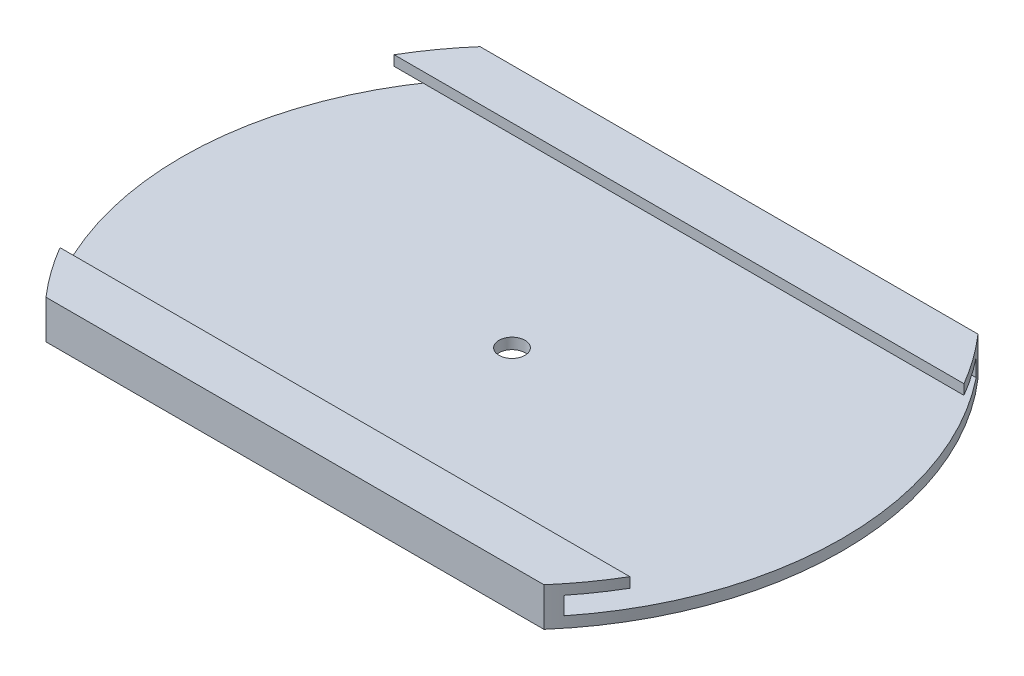
ISO-10303-21;
HEADER;
FILE_DESCRIPTION(('STEP AP214'),'2;1');
FILE_NAME('part.step','',(''),(''),'','','');
FILE_SCHEMA(('AUTOMOTIVE_DESIGN { 1 0 10303 214 1 1 1 1 }'));
ENDSEC;
DATA;
#1=APPLICATION_CONTEXT('core data for automotive mechanical design processes');
#2=APPLICATION_PROTOCOL_DEFINITION('international standard','automotive_design',2000,#1);
#3=PRODUCT_CONTEXT('',#1,'mechanical');
#4=PRODUCT('Part','Part','',(#3));
#5=PRODUCT_RELATED_PRODUCT_CATEGORY('part','',(#4));
#6=PRODUCT_DEFINITION_FORMATION('','',#4);
#7=PRODUCT_DEFINITION_CONTEXT('part definition',#1,'design');
#8=PRODUCT_DEFINITION('design','',#6,#7);
#9=PRODUCT_DEFINITION_SHAPE('','',#8);
#10=(LENGTH_UNIT() NAMED_UNIT(*) SI_UNIT(.MILLI.,.METRE.));
#11=(NAMED_UNIT(*) PLANE_ANGLE_UNIT() SI_UNIT($,.RADIAN.));
#12=(NAMED_UNIT(*) SI_UNIT($,.STERADIAN.) SOLID_ANGLE_UNIT());
#13=UNCERTAINTY_MEASURE_WITH_UNIT(LENGTH_MEASURE(1.E-05),#10,'distance_accuracy_value','');
#14=(GEOMETRIC_REPRESENTATION_CONTEXT(3) GLOBAL_UNCERTAINTY_ASSIGNED_CONTEXT((#13)) GLOBAL_UNIT_ASSIGNED_CONTEXT((#10,
#11,#12)) REPRESENTATION_CONTEXT('',''));
#15=CARTESIAN_POINT('',(0.,0.,0.));
#16=DIRECTION('',(0.,0.,1.));
#17=DIRECTION('',(1.,0.,0.));
#18=AXIS2_PLACEMENT_3D('',#15,#16,#17);
#19=CARTESIAN_POINT('',(0.,8.9,0.));
#20=DIRECTION('',(0.,-1.,0.));
#21=DIRECTION('',(0.,0.,-1.));
#22=AXIS2_PLACEMENT_3D('',#19,#20,#21);
#23=PLANE('',#22);
#24=CARTESIAN_POINT('',(0.,8.9,0.));
#25=DIRECTION('',(0.,1.,0.));
#26=DIRECTION('',(0.,0.,-1.));
#27=AXIS2_PLACEMENT_3D('',#24,#25,#26);
#28=CIRCLE('',#27,76.0150807406004);
#29=CARTESIAN_POINT('',(57.3,8.9,49.95));
#30=VERTEX_POINT('',#29);
#31=CARTESIAN_POINT('',(65.5735464955191,8.9,38.45));
#32=VERTEX_POINT('',#31);
#33=EDGE_CURVE('E229',#30,#32,#28,.T.);
#34=ORIENTED_EDGE('',*,*,#33,.T.);
#35=DIRECTION('',(1.,0.,0.));
#36=VECTOR('',#35,1.);
#37=CARTESIAN_POINT('',(-76.0150807406004,8.9,38.45));
#38=LINE('',#37,#36);
#39=CARTESIAN_POINT('',(-65.5735464955191,8.9,38.45));
#40=VERTEX_POINT('',#39);
#41=EDGE_CURVE('E139',#40,#32,#38,.T.);
#42=ORIENTED_EDGE('',*,*,#41,.F.);
#43=CARTESIAN_POINT('',(0.,8.9,0.));
#44=DIRECTION('',(0.,1.,0.));
#45=DIRECTION('',(0.,0.,1.));
#46=AXIS2_PLACEMENT_3D('',#43,#44,#45);
#47=CIRCLE('',#46,76.0150807406004);
#48=CARTESIAN_POINT('',(-57.3,8.9,49.95));
#49=VERTEX_POINT('',#48);
#50=EDGE_CURVE('E156',#40,#49,#47,.T.);
#51=ORIENTED_EDGE('',*,*,#50,.T.);
#52=DIRECTION('',(1.,0.,0.));
#53=VECTOR('',#52,1.);
#54=CARTESIAN_POINT('',(-57.3,8.9,49.95));
#55=LINE('',#54,#53);
#56=EDGE_CURVE('E155',#49,#30,#55,.T.);
#57=ORIENTED_EDGE('',*,*,#56,.T.);
#58=EDGE_LOOP('',(#34,#42,#51,#57));
#59=FACE_BOUND('',#58,.T.);
#60=ADVANCED_FACE('F45',(#59),#23,.F.);
#61=CARTESIAN_POINT('',(-76.0150807406004,6.5801244353372,47.45));
#62=DIRECTION('',(0.,1.,0.));
#63=DIRECTION('',(0.,0.,1.));
#64=AXIS2_PLACEMENT_3D('',#61,#62,#63);
#65=PLANE('',#64);
#66=CARTESIAN_POINT('',(0.,6.5801244353372,0.));
#67=DIRECTION('',(0.,1.,0.));
#68=DIRECTION('',(0.,0.,1.));
#69=AXIS2_PLACEMENT_3D('',#66,#67,#68);
#70=CIRCLE('',#69,76.0150807406004);
#71=CARTESIAN_POINT('',(-65.5735464955191,6.5801244353372,38.45));
#72=VERTEX_POINT('',#71);
#73=CARTESIAN_POINT('',(-59.3867830413468,6.5801244353372,47.45));
#74=VERTEX_POINT('',#73);
#75=EDGE_CURVE('E189',#72,#74,#70,.T.);
#76=ORIENTED_EDGE('',*,*,#75,.F.);
#77=DIRECTION('',(1.,0.,0.));
#78=VECTOR('',#77,1.);
#79=CARTESIAN_POINT('',(-76.0150807406004,6.5801244353372,38.45));
#80=LINE('',#79,#78);
#81=CARTESIAN_POINT('',(65.5735464955191,6.5801244353372,38.45));
#82=VERTEX_POINT('',#81);
#83=EDGE_CURVE('E11',#72,#82,#80,.T.);
#84=ORIENTED_EDGE('',*,*,#83,.T.);
#85=CARTESIAN_POINT('',(0.,6.5801244353372,0.));
#86=DIRECTION('',(0.,1.,0.));
#87=DIRECTION('',(0.,0.,1.));
#88=AXIS2_PLACEMENT_3D('',#85,#86,#87);
#89=CIRCLE('',#88,76.0150807406004);
#90=CARTESIAN_POINT('',(59.3867830413468,6.5801244353372,47.45));
#91=VERTEX_POINT('',#90);
#92=EDGE_CURVE('E226',#91,#82,#89,.T.);
#93=ORIENTED_EDGE('',*,*,#92,.F.);
#94=DIRECTION('',(1.,0.,0.));
#95=VECTOR('',#94,1.);
#96=CARTESIAN_POINT('',(-76.0150807406004,6.5801244353372,47.45));
#97=LINE('',#96,#95);
#98=EDGE_CURVE('E212',#74,#91,#97,.T.);
#99=ORIENTED_EDGE('',*,*,#98,.F.);
#100=EDGE_LOOP('',(#76,#84,#93,#99));
#101=FACE_BOUND('',#100,.T.);
#102=ADVANCED_FACE('F250',(#101),#65,.F.);
#103=CARTESIAN_POINT('',(0.,8.9,0.));
#104=DIRECTION('',(0.,-1.,0.));
#105=DIRECTION('',(0.,0.,-1.));
#106=AXIS2_PLACEMENT_3D('',#103,#104,#105);
#107=CYLINDRICAL_SURFACE('',#106,76.0150807406004);
#108=ORIENTED_EDGE('',*,*,#92,.T.);
#109=DIRECTION('',(0.,-1.,0.));
#110=VECTOR('',#109,1.);
#111=CARTESIAN_POINT('',(65.5735464955191,8.9,38.45));
#112=LINE('',#111,#110);
#113=EDGE_CURVE('E61',#82,#32,#112,.F.);
#114=ORIENTED_EDGE('',*,*,#113,.T.);
#115=ORIENTED_EDGE('',*,*,#33,.F.);
#116=DIRECTION('',(0.,-1.,0.));
#117=VECTOR('',#116,1.);
#118=CARTESIAN_POINT('',(57.3,8.9,49.95));
#119=LINE('',#118,#117);
#120=CARTESIAN_POINT('',(57.3,0.,49.95));
#121=VERTEX_POINT('',#120);
#122=EDGE_CURVE('E158',#30,#121,#119,.T.);
#123=ORIENTED_EDGE('',*,*,#122,.T.);
#124=CARTESIAN_POINT('',(0.,0.,0.));
#125=DIRECTION('',(0.,1.,0.));
#126=DIRECTION('',(0.,0.,-1.));
#127=AXIS2_PLACEMENT_3D('',#124,#125,#126);
#128=CIRCLE('',#127,76.0150807406004);
#129=CARTESIAN_POINT('',(57.3,0.,-49.95));
#130=VERTEX_POINT('',#129);
#131=EDGE_CURVE('E163',#121,#130,#128,.T.);
#132=ORIENTED_EDGE('',*,*,#131,.T.);
#133=DIRECTION('',(0.,-1.,0.));
#134=VECTOR('',#133,1.);
#135=CARTESIAN_POINT('',(57.3,8.9,-49.95));
#136=LINE('',#135,#134);
#137=CARTESIAN_POINT('',(57.3,8.9,-49.95));
#138=VERTEX_POINT('',#137);
#139=EDGE_CURVE('E181',#138,#130,#136,.T.);
#140=ORIENTED_EDGE('',*,*,#139,.F.);
#141=CARTESIAN_POINT('',(65.5735464955191,8.9,-38.45));
#142=VERTEX_POINT('',#141);
#143=EDGE_CURVE('E173',#142,#138,#28,.T.);
#144=ORIENTED_EDGE('',*,*,#143,.F.);
#145=DIRECTION('',(0.,-1.,0.));
#146=VECTOR('',#145,1.);
#147=CARTESIAN_POINT('',(65.5735464955191,8.9,-38.45));
#148=LINE('',#147,#146);
#149=CARTESIAN_POINT('',(65.5735464955191,6.5801244353372,-38.45));
#150=VERTEX_POINT('',#149);
#151=EDGE_CURVE('E135',#142,#150,#148,.T.);
#152=ORIENTED_EDGE('',*,*,#151,.T.);
#153=CARTESIAN_POINT('',(59.3867830413468,6.5801244353372,-47.45));
#154=VERTEX_POINT('',#153);
#155=EDGE_CURVE('E199',#150,#154,#89,.T.);
#156=ORIENTED_EDGE('',*,*,#155,.T.);
#157=DIRECTION('',(0.,-1.,0.));
#158=VECTOR('',#157,1.);
#159=CARTESIAN_POINT('',(59.3867830413468,8.9,-47.45));
#160=LINE('',#159,#158);
#161=CARTESIAN_POINT('',(59.3867830413468,2.5,-47.45));
#162=VERTEX_POINT('',#161);
#163=EDGE_CURVE('E224',#154,#162,#160,.T.);
#164=ORIENTED_EDGE('',*,*,#163,.T.);
#165=CARTESIAN_POINT('',(0.,2.5,0.));
#166=DIRECTION('',(0.,-1.,0.));
#167=DIRECTION('',(0.,0.,-1.));
#168=AXIS2_PLACEMENT_3D('',#165,#166,#167);
#169=CIRCLE('',#168,76.0150807406004);
#170=CARTESIAN_POINT('',(59.3867830413468,2.5,47.45));
#171=VERTEX_POINT('',#170);
#172=EDGE_CURVE('E215',#162,#171,#169,.T.);
#173=ORIENTED_EDGE('',*,*,#172,.T.);
#174=DIRECTION('',(0.,-1.,0.));
#175=VECTOR('',#174,1.);
#176=CARTESIAN_POINT('',(59.3867830413468,8.9,47.45));
#177=LINE('',#176,#175);
#178=EDGE_CURVE('E167',#171,#91,#177,.F.);
#179=ORIENTED_EDGE('',*,*,#178,.T.);
#180=EDGE_LOOP('',(#108,#114,#115,#123,#132,#140,#144,#152,#156,#164,#173,#179));
#181=FACE_BOUND('',#180,.T.);
#182=ADVANCED_FACE('F47',(#181),#107,.T.);
#183=CARTESIAN_POINT('',(-57.3,8.9,-49.95));
#184=DIRECTION('',(0.,0.,1.));
#185=DIRECTION('',(1.,0.,0.));
#186=AXIS2_PLACEMENT_3D('',#183,#184,#185);
#187=PLANE('',#186);
#188=DIRECTION('',(-1.,0.,0.));
#189=VECTOR('',#188,1.);
#190=CARTESIAN_POINT('',(-57.3,0.,-49.95));
#191=LINE('',#190,#189);
#192=CARTESIAN_POINT('',(-57.3,0.,-49.95));
#193=VERTEX_POINT('',#192);
#194=EDGE_CURVE('E166',#130,#193,#191,.T.);
#195=ORIENTED_EDGE('',*,*,#194,.T.);
#196=DIRECTION('',(0.,-1.,0.));
#197=VECTOR('',#196,1.);
#198=CARTESIAN_POINT('',(-57.3,8.9,-49.95));
#199=LINE('',#198,#197);
#200=CARTESIAN_POINT('',(-57.3,8.9,-49.95));
#201=VERTEX_POINT('',#200);
#202=EDGE_CURVE('E179',#201,#193,#199,.T.);
#203=ORIENTED_EDGE('',*,*,#202,.F.);
#204=DIRECTION('',(-1.,0.,0.));
#205=VECTOR('',#204,1.);
#206=CARTESIAN_POINT('',(-57.3,8.9,-49.95));
#207=LINE('',#206,#205);
#208=EDGE_CURVE('E153',#138,#201,#207,.T.);
#209=ORIENTED_EDGE('',*,*,#208,.F.);
#210=ORIENTED_EDGE('',*,*,#139,.T.);
#211=EDGE_LOOP('',(#195,#203,#209,#210));
#212=FACE_BOUND('',#211,.T.);
#213=ADVANCED_FACE('F235',(#212),#187,.F.);
#214=CARTESIAN_POINT('',(0.,8.9,0.));
#215=DIRECTION('',(0.,-1.,0.));
#216=DIRECTION('',(0.,0.,-1.));
#217=AXIS2_PLACEMENT_3D('',#214,#215,#216);
#218=CYLINDRICAL_SURFACE('',#217,76.0150807406004);
#219=ORIENTED_EDGE('',*,*,#50,.F.);
#220=DIRECTION('',(0.,-1.,0.));
#221=VECTOR('',#220,1.);
#222=CARTESIAN_POINT('',(-65.5735464955191,8.9,38.45));
#223=LINE('',#222,#221);
#224=EDGE_CURVE('E205',#40,#72,#223,.T.);
#225=ORIENTED_EDGE('',*,*,#224,.T.);
#226=ORIENTED_EDGE('',*,*,#75,.T.);
#227=DIRECTION('',(0.,-1.,0.));
#228=VECTOR('',#227,1.);
#229=CARTESIAN_POINT('',(-59.3867830413468,8.9,47.45));
#230=LINE('',#229,#228);
#231=CARTESIAN_POINT('',(-59.3867830413468,2.5,47.45));
#232=VERTEX_POINT('',#231);
#233=EDGE_CURVE('E191',#74,#232,#230,.T.);
#234=ORIENTED_EDGE('',*,*,#233,.T.);
#235=CARTESIAN_POINT('',(0.,2.5,0.));
#236=DIRECTION('',(0.,-1.,0.));
#237=DIRECTION('',(0.,0.,-1.));
#238=AXIS2_PLACEMENT_3D('',#235,#236,#237);
#239=CIRCLE('',#238,76.0150807406004);
#240=CARTESIAN_POINT('',(-59.3867830413468,2.5,-47.45));
#241=VERTEX_POINT('',#240);
#242=EDGE_CURVE('E184',#232,#241,#239,.T.);
#243=ORIENTED_EDGE('',*,*,#242,.T.);
#244=DIRECTION('',(0.,-1.,0.));
#245=VECTOR('',#244,1.);
#246=CARTESIAN_POINT('',(-59.3867830413468,8.9,-47.45));
#247=LINE('',#246,#245);
#248=CARTESIAN_POINT('',(-59.3867830413468,6.5801244353372,-47.45));
#249=VERTEX_POINT('',#248);
#250=EDGE_CURVE('E187',#241,#249,#247,.F.);
#251=ORIENTED_EDGE('',*,*,#250,.T.);
#252=CARTESIAN_POINT('',(-65.5735464955191,6.5801244353372,-38.45));
#253=VERTEX_POINT('',#252);
#254=EDGE_CURVE('E149',#249,#253,#70,.T.);
#255=ORIENTED_EDGE('',*,*,#254,.T.);
#256=DIRECTION('',(0.,-1.,0.));
#257=VECTOR('',#256,1.);
#258=CARTESIAN_POINT('',(-65.5735464955191,8.9,-38.45));
#259=LINE('',#258,#257);
#260=CARTESIAN_POINT('',(-65.5735464955191,8.9,-38.45));
#261=VERTEX_POINT('',#260);
#262=EDGE_CURVE('E68',#253,#261,#259,.F.);
#263=ORIENTED_EDGE('',*,*,#262,.T.);
#264=EDGE_CURVE('E147',#201,#261,#47,.T.);
#265=ORIENTED_EDGE('',*,*,#264,.F.);
#266=ORIENTED_EDGE('',*,*,#202,.T.);
#267=CARTESIAN_POINT('',(0.,0.,0.));
#268=DIRECTION('',(0.,1.,0.));
#269=DIRECTION('',(0.,0.,1.));
#270=AXIS2_PLACEMENT_3D('',#267,#268,#269);
#271=CIRCLE('',#270,76.0150807406004);
#272=CARTESIAN_POINT('',(-57.3,0.,49.95));
#273=VERTEX_POINT('',#272);
#274=EDGE_CURVE('E169',#193,#273,#271,.T.);
#275=ORIENTED_EDGE('',*,*,#274,.T.);
#276=DIRECTION('',(0.,-1.,0.));
#277=VECTOR('',#276,1.);
#278=CARTESIAN_POINT('',(-57.3,8.9,49.95));
#279=LINE('',#278,#277);
#280=EDGE_CURVE('E176',#49,#273,#279,.T.);
#281=ORIENTED_EDGE('',*,*,#280,.F.);
#282=EDGE_LOOP('',(#219,#225,#226,#234,#243,#251,#255,#263,#265,#266,#275,#281));
#283=FACE_BOUND('',#282,.T.);
#284=ADVANCED_FACE('F145',(#283),#218,.T.);
#285=CARTESIAN_POINT('',(-57.3,8.9,49.95));
#286=DIRECTION('',(0.,0.,-1.));
#287=DIRECTION('',(-1.,0.,0.));
#288=AXIS2_PLACEMENT_3D('',#285,#286,#287);
#289=PLANE('',#288);
#290=DIRECTION('',(1.,0.,0.));
#291=VECTOR('',#290,1.);
#292=CARTESIAN_POINT('',(-57.3,0.,49.95));
#293=LINE('',#292,#291);
#294=EDGE_CURVE('E171',#273,#121,#293,.T.);
#295=ORIENTED_EDGE('',*,*,#294,.T.);
#296=ORIENTED_EDGE('',*,*,#122,.F.);
#297=ORIENTED_EDGE('',*,*,#56,.F.);
#298=ORIENTED_EDGE('',*,*,#280,.T.);
#299=EDGE_LOOP('',(#295,#296,#297,#298));
#300=FACE_BOUND('',#299,.T.);
#301=ADVANCED_FACE('F245',(#300),#289,.F.);
#302=ORIENTED_EDGE('',*,*,#264,.T.);
#303=DIRECTION('',(1.,0.,0.));
#304=VECTOR('',#303,1.);
#305=CARTESIAN_POINT('',(-76.0150807406004,8.9,-38.45));
#306=LINE('',#305,#304);
#307=EDGE_CURVE('E132',#261,#142,#306,.T.);
#308=ORIENTED_EDGE('',*,*,#307,.T.);
#309=ORIENTED_EDGE('',*,*,#143,.T.);
#310=ORIENTED_EDGE('',*,*,#208,.T.);
#311=EDGE_LOOP('',(#302,#308,#309,#310));
#312=FACE_BOUND('',#311,.T.);
#313=ADVANCED_FACE('F151',(#312),#23,.F.);
#314=CARTESIAN_POINT('',(0.,0.,0.));
#315=DIRECTION('',(0.,-1.,0.));
#316=DIRECTION('',(0.,0.,-1.));
#317=AXIS2_PLACEMENT_3D('',#314,#315,#316);
#318=PLANE('',#317);
#319=CARTESIAN_POINT('',(0.,0.,0.));
#320=DIRECTION('',(0.,1.,0.));
#321=DIRECTION('',(0.,0.,1.));
#322=AXIS2_PLACEMENT_3D('',#319,#320,#321);
#323=CIRCLE('',#322,3.);
#324=CARTESIAN_POINT('',(0.,0.,3.));
#325=VERTEX_POINT('',#324);
#326=EDGE_CURVE('E423',#325,#325,#323,.T.);
#327=ORIENTED_EDGE('',*,*,#326,.T.);
#328=EDGE_LOOP('',(#327));
#329=FACE_BOUND('',#328,.T.);
#330=ORIENTED_EDGE('',*,*,#131,.F.);
#331=ORIENTED_EDGE('',*,*,#294,.F.);
#332=ORIENTED_EDGE('',*,*,#274,.F.);
#333=ORIENTED_EDGE('',*,*,#194,.F.);
#334=EDGE_LOOP('',(#330,#331,#332,#333));
#335=FACE_BOUND('',#334,.T.);
#336=ADVANCED_FACE('F240',(#329,#335),#318,.T.);
#337=CARTESIAN_POINT('',(-76.0150807406004,6.5801244353372,47.45));
#338=DIRECTION('',(0.,0.,1.));
#339=DIRECTION('',(1.,0.,0.));
#340=AXIS2_PLACEMENT_3D('',#337,#338,#339);
#341=PLANE('',#340);
#342=DIRECTION('',(1.,0.,0.));
#343=VECTOR('',#342,1.);
#344=CARTESIAN_POINT('',(-76.0150807406004,2.5,47.45));
#345=LINE('',#344,#343);
#346=EDGE_CURVE('E211',#232,#171,#345,.T.);
#347=ORIENTED_EDGE('',*,*,#346,.F.);
#348=ORIENTED_EDGE('',*,*,#233,.F.);
#349=ORIENTED_EDGE('',*,*,#98,.T.);
#350=ORIENTED_EDGE('',*,*,#178,.F.);
#351=EDGE_LOOP('',(#347,#348,#349,#350));
#352=FACE_BOUND('',#351,.T.);
#353=ADVANCED_FACE('F254',(#352),#341,.F.);
#354=ORIENTED_EDGE('',*,*,#155,.F.);
#355=DIRECTION('',(-1.,0.,0.));
#356=VECTOR('',#355,1.);
#357=CARTESIAN_POINT('',(-76.0150807406004,6.5801244353372,-38.45));
#358=LINE('',#357,#356);
#359=EDGE_CURVE('E54',#150,#253,#358,.T.);
#360=ORIENTED_EDGE('',*,*,#359,.T.);
#361=ORIENTED_EDGE('',*,*,#254,.F.);
#362=DIRECTION('',(1.,0.,0.));
#363=VECTOR('',#362,1.);
#364=CARTESIAN_POINT('',(-76.0150807406004,6.5801244353372,-47.45));
#365=LINE('',#364,#363);
#366=EDGE_CURVE('E216',#249,#154,#365,.T.);
#367=ORIENTED_EDGE('',*,*,#366,.T.);
#368=EDGE_LOOP('',(#354,#360,#361,#367));
#369=FACE_BOUND('',#368,.T.);
#370=ADVANCED_FACE('F196',(#369),#65,.F.);
#371=CARTESIAN_POINT('',(-76.0150807406004,6.5801244353372,-47.45));
#372=DIRECTION('',(0.,0.,-1.));
#373=DIRECTION('',(-1.,0.,0.));
#374=AXIS2_PLACEMENT_3D('',#371,#372,#373);
#375=PLANE('',#374);
#376=ORIENTED_EDGE('',*,*,#366,.F.);
#377=ORIENTED_EDGE('',*,*,#250,.F.);
#378=DIRECTION('',(1.,0.,0.));
#379=VECTOR('',#378,1.);
#380=CARTESIAN_POINT('',(-76.0150807406004,2.5,-47.45));
#381=LINE('',#380,#379);
#382=EDGE_CURVE('E218',#241,#162,#381,.T.);
#383=ORIENTED_EDGE('',*,*,#382,.T.);
#384=ORIENTED_EDGE('',*,*,#163,.F.);
#385=EDGE_LOOP('',(#376,#377,#383,#384));
#386=FACE_BOUND('',#385,.T.);
#387=ADVANCED_FACE('F259',(#386),#375,.F.);
#388=CARTESIAN_POINT('',(-76.0150807406004,2.5,47.45));
#389=DIRECTION('',(0.,-1.,0.));
#390=DIRECTION('',(0.,0.,-1.));
#391=AXIS2_PLACEMENT_3D('',#388,#389,#390);
#392=PLANE('',#391);
#393=CARTESIAN_POINT('',(0.,2.5,0.));
#394=DIRECTION('',(0.,-1.,0.));
#395=DIRECTION('',(0.,0.,-1.));
#396=AXIS2_PLACEMENT_3D('',#393,#394,#395);
#397=CIRCLE('',#396,3.);
#398=CARTESIAN_POINT('',(0.,2.5,-3.));
#399=VERTEX_POINT('',#398);
#400=EDGE_CURVE('E49',#399,#399,#397,.T.);
#401=ORIENTED_EDGE('',*,*,#400,.T.);
#402=EDGE_LOOP('',(#401));
#403=FACE_BOUND('',#402,.T.);
#404=ORIENTED_EDGE('',*,*,#382,.F.);
#405=ORIENTED_EDGE('',*,*,#242,.F.);
#406=ORIENTED_EDGE('',*,*,#346,.T.);
#407=ORIENTED_EDGE('',*,*,#172,.F.);
#408=EDGE_LOOP('',(#404,#405,#406,#407));
#409=FACE_BOUND('',#408,.T.);
#410=ADVANCED_FACE('F256',(#403,#409),#392,.F.);
#411=CARTESIAN_POINT('',(-76.0150807406004,8.9,-38.45));
#412=DIRECTION('',(0.,0.,-1.));
#413=DIRECTION('',(-1.,0.,0.));
#414=AXIS2_PLACEMENT_3D('',#411,#412,#413);
#415=PLANE('',#414);
#416=ORIENTED_EDGE('',*,*,#307,.F.);
#417=ORIENTED_EDGE('',*,*,#262,.F.);
#418=ORIENTED_EDGE('',*,*,#359,.F.);
#419=ORIENTED_EDGE('',*,*,#151,.F.);
#420=EDGE_LOOP('',(#416,#417,#418,#419));
#421=FACE_BOUND('',#420,.T.);
#422=ADVANCED_FACE('F133',(#421),#415,.F.);
#423=CARTESIAN_POINT('',(-76.0150807406004,8.9,38.45));
#424=DIRECTION('',(0.,0.,1.));
#425=DIRECTION('',(1.,0.,0.));
#426=AXIS2_PLACEMENT_3D('',#423,#424,#425);
#427=PLANE('',#426);
#428=ORIENTED_EDGE('',*,*,#83,.F.);
#429=ORIENTED_EDGE('',*,*,#224,.F.);
#430=ORIENTED_EDGE('',*,*,#41,.T.);
#431=ORIENTED_EDGE('',*,*,#113,.F.);
#432=EDGE_LOOP('',(#428,#429,#430,#431));
#433=FACE_BOUND('',#432,.T.);
#434=ADVANCED_FACE('F374',(#433),#427,.F.);
#435=CARTESIAN_POINT('',(0.,0.,0.));
#436=DIRECTION('',(0.,1.,0.));
#437=DIRECTION('',(0.,0.,1.));
#438=AXIS2_PLACEMENT_3D('',#435,#436,#437);
#439=CYLINDRICAL_SURFACE('',#438,3.);
#440=ORIENTED_EDGE('',*,*,#326,.F.);
#441=EDGE_LOOP('',(#440));
#442=FACE_BOUND('',#441,.T.);
#443=ORIENTED_EDGE('',*,*,#400,.F.);
#444=EDGE_LOOP('',(#443));
#445=FACE_BOUND('',#444,.T.);
#446=ADVANCED_FACE('F384',(#442,#445),#439,.F.);
#447=CLOSED_SHELL('',(#60,#102,#182,#213,#284,#301,#313,#336,#353,#370,#387,#410,#422,#434,#446));
#448=MANIFOLD_SOLID_BREP('B2',#447);
#449=ADVANCED_BREP_SHAPE_REPRESENTATION('',(#18,#448),#14);
#450=SHAPE_DEFINITION_REPRESENTATION(#9,#449);
ENDSEC;
END-ISO-10303-21;
